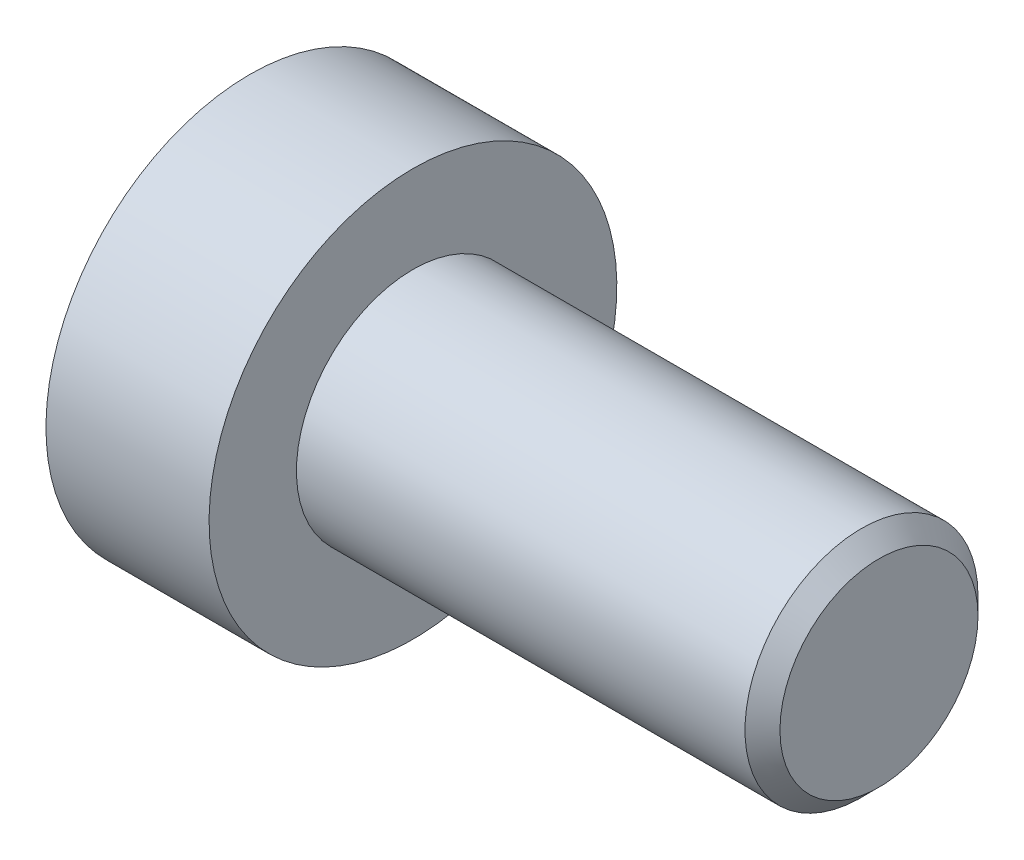
ISO-10303-21;
HEADER;
FILE_DESCRIPTION(('STEP AP214'),'2;1');
FILE_NAME('part.step','',(''),(''),'','','');
FILE_SCHEMA(('AUTOMOTIVE_DESIGN { 1 0 10303 214 1 1 1 1 }'));
ENDSEC;
DATA;
#1=APPLICATION_CONTEXT('core data for automotive mechanical design processes');
#2=APPLICATION_PROTOCOL_DEFINITION('international standard','automotive_design',2000,#1);
#3=PRODUCT_CONTEXT('',#1,'mechanical');
#4=PRODUCT('Part','Part','',(#3));
#5=PRODUCT_RELATED_PRODUCT_CATEGORY('part','',(#4));
#6=PRODUCT_DEFINITION_FORMATION('','',#4);
#7=PRODUCT_DEFINITION_CONTEXT('part definition',#1,'design');
#8=PRODUCT_DEFINITION('design','',#6,#7);
#9=PRODUCT_DEFINITION_SHAPE('','',#8);
#10=(LENGTH_UNIT() NAMED_UNIT(*) SI_UNIT(.MILLI.,.METRE.));
#11=(NAMED_UNIT(*) PLANE_ANGLE_UNIT() SI_UNIT($,.RADIAN.));
#12=(NAMED_UNIT(*) SI_UNIT($,.STERADIAN.) SOLID_ANGLE_UNIT());
#13=UNCERTAINTY_MEASURE_WITH_UNIT(LENGTH_MEASURE(1.E-05),#10,'distance_accuracy_value','');
#14=(GEOMETRIC_REPRESENTATION_CONTEXT(3) GLOBAL_UNCERTAINTY_ASSIGNED_CONTEXT((#13)) GLOBAL_UNIT_ASSIGNED_CONTEXT((#10,
#11,#12)) REPRESENTATION_CONTEXT('',''));
#15=CARTESIAN_POINT('',(0.,0.,0.));
#16=DIRECTION('',(0.,0.,1.));
#17=DIRECTION('',(1.,0.,0.));
#18=AXIS2_PLACEMENT_3D('',#15,#16,#17);
#19=CARTESIAN_POINT('',(-8.,0.,0.));
#20=DIRECTION('',(1.,0.,0.));
#21=DIRECTION('',(0.,0.,-1.));
#22=AXIS2_PLACEMENT_3D('',#19,#20,#21);
#23=CYLINDRICAL_SURFACE('',#22,2.);
#24=CARTESIAN_POINT('',(-0.300000000000001,0.,0.));
#25=DIRECTION('',(1.,0.,0.));
#26=DIRECTION('',(0.,0.,-1.));
#27=AXIS2_PLACEMENT_3D('',#24,#25,#26);
#28=CIRCLE('',#27,2.);
#29=CARTESIAN_POINT('',(-0.300000000000001,0.,-2.));
#30=VERTEX_POINT('',#29);
#31=EDGE_CURVE('E46',#30,#30,#28,.F.);
#32=ORIENTED_EDGE('',*,*,#31,.T.);
#33=EDGE_LOOP('',(#32));
#34=FACE_BOUND('',#33,.T.);
#35=CARTESIAN_POINT('',(-8.,0.,0.));
#36=DIRECTION('',(1.,0.,0.));
#37=DIRECTION('',(0.,1.,0.));
#38=AXIS2_PLACEMENT_3D('',#35,#36,#37);
#39=CIRCLE('',#38,2.);
#40=CARTESIAN_POINT('',(-8.,1.99999999999999,0.));
#41=VERTEX_POINT('',#40);
#42=EDGE_CURVE('E122',#41,#41,#39,.F.);
#43=ORIENTED_EDGE('',*,*,#42,.F.);
#44=EDGE_LOOP('',(#43));
#45=FACE_BOUND('',#44,.T.);
#46=ADVANCED_FACE('F33',(#34,#45),#23,.T.);
#47=CARTESIAN_POINT('',(0.,0.,0.));
#48=DIRECTION('',(1.,0.,0.));
#49=DIRECTION('',(0.,0.,-1.));
#50=AXIS2_PLACEMENT_3D('',#47,#48,#49);
#51=PLANE('',#50);
#52=CARTESIAN_POINT('',(0.,0.,0.));
#53=DIRECTION('',(1.,0.,0.));
#54=DIRECTION('',(0.,0.,-1.));
#55=AXIS2_PLACEMENT_3D('',#52,#53,#54);
#56=CIRCLE('',#55,1.7);
#57=CARTESIAN_POINT('',(0.,0.,-1.7));
#58=VERTEX_POINT('',#57);
#59=EDGE_CURVE('E125',#58,#58,#56,.T.);
#60=ORIENTED_EDGE('',*,*,#59,.T.);
#61=EDGE_LOOP('',(#60));
#62=FACE_BOUND('',#61,.T.);
#63=ADVANCED_FACE('F135',(#62),#51,.T.);
#64=CARTESIAN_POINT('',(0.,0.,0.));
#65=DIRECTION('',(-1.,0.,0.));
#66=DIRECTION('',(0.,0.,1.));
#67=AXIS2_PLACEMENT_3D('',#64,#65,#66);
#68=CONICAL_SURFACE('',#67,1.7,0.785398163397446);
#69=ORIENTED_EDGE('',*,*,#31,.F.);
#70=EDGE_LOOP('',(#69));
#71=FACE_BOUND('',#70,.T.);
#72=ORIENTED_EDGE('',*,*,#59,.F.);
#73=EDGE_LOOP('',(#72));
#74=FACE_BOUND('',#73,.T.);
#75=ADVANCED_FACE('F35',(#71,#74),#68,.T.);
#76=CARTESIAN_POINT('',(-10.8,0.,0.));
#77=DIRECTION('',(-1.,0.,0.));
#78=DIRECTION('',(0.,-1.,0.));
#79=AXIS2_PLACEMENT_3D('',#76,#77,#78);
#80=PLANE('',#79);
#81=CARTESIAN_POINT('',(-10.8,0.,0.));
#82=DIRECTION('',(-1.,0.,0.));
#83=DIRECTION('',(0.,-1.,0.));
#84=AXIS2_PLACEMENT_3D('',#81,#82,#83);
#85=CIRCLE('',#84,1.49337567297408);
#86=CARTESIAN_POINT('',(-10.8,-1.49337567297404,0.));
#87=VERTEX_POINT('',#86);
#88=EDGE_CURVE('E235',#87,#87,#85,.T.);
#89=ORIENTED_EDGE('',*,*,#88,.F.);
#90=EDGE_LOOP('',(#89));
#91=FACE_BOUND('',#90,.T.);
#92=CARTESIAN_POINT('',(-10.8,0.,0.));
#93=DIRECTION('',(1.,0.,0.));
#94=DIRECTION('',(0.,1.,0.));
#95=AXIS2_PLACEMENT_3D('',#92,#93,#94);
#96=CIRCLE('',#95,3.5);
#97=CARTESIAN_POINT('',(-10.8,3.5,0.));
#98=VERTEX_POINT('',#97);
#99=EDGE_CURVE('E119',#98,#98,#96,.T.);
#100=ORIENTED_EDGE('',*,*,#99,.F.);
#101=EDGE_LOOP('',(#100));
#102=FACE_BOUND('',#101,.T.);
#103=ADVANCED_FACE('F134',(#91,#102),#80,.T.);
#104=CARTESIAN_POINT('',(-8.,0.,0.));
#105=DIRECTION('',(1.,0.,0.));
#106=DIRECTION('',(0.,1.,0.));
#107=AXIS2_PLACEMENT_3D('',#104,#105,#106);
#108=CYLINDRICAL_SURFACE('',#107,3.5);
#109=ORIENTED_EDGE('',*,*,#99,.T.);
#110=EDGE_LOOP('',(#109));
#111=FACE_BOUND('',#110,.T.);
#112=CARTESIAN_POINT('',(-8.,0.,0.));
#113=DIRECTION('',(1.,0.,0.));
#114=DIRECTION('',(0.,1.,0.));
#115=AXIS2_PLACEMENT_3D('',#112,#113,#114);
#116=CIRCLE('',#115,3.5);
#117=CARTESIAN_POINT('',(-8.,3.5,0.));
#118=VERTEX_POINT('',#117);
#119=EDGE_CURVE('E116',#118,#118,#116,.T.);
#120=ORIENTED_EDGE('',*,*,#119,.F.);
#121=EDGE_LOOP('',(#120));
#122=FACE_BOUND('',#121,.T.);
#123=ADVANCED_FACE('F146',(#111,#122),#108,.T.);
#124=CARTESIAN_POINT('',(-8.,3.5,0.));
#125=DIRECTION('',(1.,0.,0.));
#126=DIRECTION('',(0.,1.,0.));
#127=AXIS2_PLACEMENT_3D('',#124,#125,#126);
#128=PLANE('',#127);
#129=ORIENTED_EDGE('',*,*,#42,.T.);
#130=EDGE_LOOP('',(#129));
#131=FACE_BOUND('',#130,.T.);
#132=ORIENTED_EDGE('',*,*,#119,.T.);
#133=EDGE_LOOP('',(#132));
#134=FACE_BOUND('',#133,.T.);
#135=ADVANCED_FACE('F150',(#131,#134),#128,.T.);
#136=CARTESIAN_POINT('',(-10.8,0.,0.));
#137=DIRECTION('',(-1.,0.,0.));
#138=DIRECTION('',(0.,-1.,0.));
#139=AXIS2_PLACEMENT_3D('',#136,#137,#138);
#140=CONICAL_SURFACE('',#139,1.49337567297408,0.78539816339745);
#141=ORIENTED_EDGE('',*,*,#88,.T.);
#142=EDGE_LOOP('',(#141));
#143=FACE_BOUND('',#142,.T.);
#144=CARTESIAN_POINT('',(-11.2014021689884,-1.42396736984797,1.25));
#145=CARTESIAN_POINT('',(-11.175296136448,-1.38922450814774,1.25));
#146=CARTESIAN_POINT('',(-11.1494506563431,-1.35428640192995,1.25));
#147=CARTESIAN_POINT('',(-11.0983879120234,-1.28394100441962,1.25));
#148=CARTESIAN_POINT('',(-11.0731708093588,-1.24853359598576,1.25));
#149=CARTESIAN_POINT('',(-10.9982633539511,-1.14097140016119,1.25));
#150=CARTESIAN_POINT('',(-10.9497190435972,-1.0680049582675,1.25));
#151=CARTESIAN_POINT('',(-10.8545600162985,-0.915095472420343,1.25));
#152=CARTESIAN_POINT('',(-10.8082030382604,-0.834990154954485,1.25));
#153=CARTESIAN_POINT('',(-10.7235039270025,-0.670798348959402,1.25));
#154=CARTESIAN_POINT('',(-10.6851347978723,-0.58672648793715,1.25));
#155=CARTESIAN_POINT('',(-10.6381985020476,-0.460385334768688,1.25));
#156=CARTESIAN_POINT('',(-10.6247021207698,-0.419954113336594,1.25));
#157=CARTESIAN_POINT('',(-10.6009573074475,-0.338129031291272,1.25));
#158=CARTESIAN_POINT('',(-10.5907091035293,-0.296735103284165,1.25));
#159=CARTESIAN_POINT('',(-10.5741594663552,-0.213916243687779,1.25));
#160=CARTESIAN_POINT('',(-10.5677913385525,-0.172504848949327,1.25));
#161=CARTESIAN_POINT('',(-10.5591237196608,-0.0892560954741847,1.25));
#162=CARTESIAN_POINT('',(-10.5568235599982,-0.0474188078702925,1.25));
#163=CARTESIAN_POINT('',(-10.5564564105193,0.0348235296905143,1.25));
#164=CARTESIAN_POINT('',(-10.5582455485416,0.0752279922916913,1.25));
#165=CARTESIAN_POINT('',(-10.5656448035135,0.15568700557962,1.25));
#166=CARTESIAN_POINT('',(-10.5712556629701,0.195741486737974,1.25));
#167=CARTESIAN_POINT('',(-10.5860898151071,0.275882483894682,1.25));
#168=CARTESIAN_POINT('',(-10.5953738895404,0.315957579678786,1.25));
#169=CARTESIAN_POINT('',(-10.6170656964992,0.395234027395294,1.25));
#170=CARTESIAN_POINT('',(-10.6294731489784,0.434435457318934,1.25));
#171=CARTESIAN_POINT('',(-10.6734108304631,0.558570325397133,1.25));
#172=CARTESIAN_POINT('',(-10.7099744143289,0.641718054005954,1.25));
#173=CARTESIAN_POINT('',(-10.7912478873066,0.804100725662095,1.25));
#174=CARTESIAN_POINT('',(-10.8359871895297,0.883320183915885,1.25));
#175=CARTESIAN_POINT('',(-10.9282652286461,1.03470895505823,1.25));
#176=CARTESIAN_POINT('',(-10.9755534388818,1.10703287925039,1.25));
#177=CARTESIAN_POINT('',(-11.0486463209253,1.21358798649192,1.25));
#178=CARTESIAN_POINT('',(-11.0732664432996,1.24864609054883,1.25));
#179=CARTESIAN_POINT('',(-11.123155260131,1.3182838080565,1.25));
#180=CARTESIAN_POINT('',(-11.1484237758017,1.35286354944695,1.25));
#181=CARTESIAN_POINT('',(-11.1739610581169,1.38724419886389,1.25));
#182=B_SPLINE_CURVE_WITH_KNOTS('',3,(#144,#145,#146,#147,#148,#149,#150,#151,#152,#153,#154,
#155,#156,#157,#158,#159,#160,#161,#162,#163,#164,#165,#166,#167,#168,#169,#170,#171,#172,#173,
#174,#175,#176,#177,#178,#179,#180,#181),.UNSPECIFIED.,.F.,.F.,(4,2,2,2,2,2,2,2,2,2,2,2,2,2,2,2,
2,2,4),(0.,0.130370422461749,0.26077402322928,0.523571931962181,0.800995227642792,
1.07746514553942,1.20522972687283,1.33300327939672,1.45851355132216,1.5840031936199,
1.70514602294322,1.82631239533597,1.94957373840992,2.07282403363807,2.34451838945522,
2.61721016161585,2.87631588769062,3.00482945023601,3.13330794967362),.UNSPECIFIED.);
#183=CARTESIAN_POINT('',(-10.75,-0.721687836486992,1.25));
#184=VERTEX_POINT('',#183);
#185=CARTESIAN_POINT('',(-10.75,0.721687836487073,1.25));
#186=VERTEX_POINT('',#185);
#187=EDGE_CURVE('E100',#184,#186,#182,.T.);
#188=ORIENTED_EDGE('',*,*,#187,.F.);
#189=CARTESIAN_POINT('',(-10.7501154839091,-1.44349114302786,-0.000200000000000846));
#190=CARTESIAN_POINT('',(-10.7253216680551,-1.41867941875061,0.0427751670715858));
#191=CARTESIAN_POINT('',(-10.7019837344187,-1.39345276980739,0.0864690047459472));
#192=CARTESIAN_POINT('',(-10.6592520040845,-1.3420126355419,0.175565930841941));
#193=CARTESIAN_POINT('',(-10.6398819923604,-1.31579425481272,0.220977498357063));
#194=CARTESIAN_POINT('',(-10.6067004834135,-1.26292610442242,0.312547820935259));
#195=CARTESIAN_POINT('',(-10.5928055590526,-1.23628980770467,0.358683240175884));
#196=CARTESIAN_POINT('',(-10.5713972821606,-1.18243062538504,0.451970080407591));
#197=CARTESIAN_POINT('',(-10.5638679415668,-1.15520938653757,0.499118649136378));
#198=CARTESIAN_POINT('',(-10.5570744980507,-1.10829684367463,0.58037355688725));
#199=CARTESIAN_POINT('',(-10.5560685591043,-1.08866617256954,0.614374876627939));
#200=CARTESIAN_POINT('',(-10.5577614149113,-1.04943932800607,0.682317764432475));
#201=CARTESIAN_POINT('',(-10.5604610272155,-1.02984316311595,0.716259317655656));
#202=CARTESIAN_POINT('',(-10.5694089303164,-0.99083995460346,0.783814856457497));
#203=CARTESIAN_POINT('',(-10.5756605258997,-0.971433104248731,0.817428507286773));
#204=CARTESIAN_POINT('',(-10.5913756814139,-0.932943395609866,0.884094638217811));
#205=CARTESIAN_POINT('',(-10.6008406200874,-0.913860680098261,0.917146871030293));
#206=CARTESIAN_POINT('',(-10.6289313906876,-0.864986351354528,1.00179969160026));
#207=CARTESIAN_POINT('',(-10.6496701574522,-0.835502920149036,1.05286649242964));
#208=CARTESIAN_POINT('',(-10.6963871346715,-0.777690319475868,1.15300085411325));
#209=CARTESIAN_POINT('',(-10.7223482959468,-0.749357745598376,1.20207431157827));
#210=CARTESIAN_POINT('',(-10.7501154839091,-0.721572366433154,1.2502));
#211=B_SPLINE_CURVE_WITH_KNOTS('',3,(#189,#190,#191,#192,#193,#194,#195,#196,#197,#198,#199,
#200,#201,#202,#203,#204,#205,#206,#207,#208,#209,#210),.UNSPECIFIED.,.F.,.F.,(4,2,2,2,2,2,2,2,
2,2,4),(0.,0.166533409618304,0.334037607289761,0.498880396489697,0.663307919240273,
0.780963963458825,0.898645970148451,1.01643764860773,1.13427993171549,1.32148652032141,
1.50809158792573),.UNSPECIFIED.);
#212=CARTESIAN_POINT('',(-10.75,-1.44337567297402,0.));
#213=VERTEX_POINT('',#212);
#214=EDGE_CURVE('E192',#213,#184,#211,.T.);
#215=ORIENTED_EDGE('',*,*,#214,.F.);
#216=CARTESIAN_POINT('',(-10.7501154839091,-0.721572366433153,-1.2502));
#217=CARTESIAN_POINT('',(-10.7253216680551,-0.746384090710403,-1.20722483292841));
#218=CARTESIAN_POINT('',(-10.7019837344187,-0.771610739653623,-1.16353099525405));
#219=CARTESIAN_POINT('',(-10.6592520040845,-0.823050873919114,-1.07443406915806));
#220=CARTESIAN_POINT('',(-10.6398819923604,-0.849269254648293,-1.02902250164294));
#221=CARTESIAN_POINT('',(-10.6067004834135,-0.902137405038595,-0.937452179064739));
#222=CARTESIAN_POINT('',(-10.5928055590526,-0.928773701756347,-0.891316759824114));
#223=CARTESIAN_POINT('',(-10.5713972821606,-0.982632884075973,-0.798029919592407));
#224=CARTESIAN_POINT('',(-10.5638679415668,-1.00985412292344,-0.750881350863619));
#225=CARTESIAN_POINT('',(-10.5570744980507,-1.05676666578639,-0.669626443112746));
#226=CARTESIAN_POINT('',(-10.5560685591043,-1.07639733689148,-0.635625123372058));
#227=CARTESIAN_POINT('',(-10.5577614149113,-1.11562418145495,-0.567682235567521));
#228=CARTESIAN_POINT('',(-10.5604610272155,-1.13522034634506,-0.533740682344341));
#229=CARTESIAN_POINT('',(-10.5694089303164,-1.17422355485756,-0.466185143542499));
#230=CARTESIAN_POINT('',(-10.5756605258997,-1.19363040521229,-0.432571492713224));
#231=CARTESIAN_POINT('',(-10.5913756814139,-1.23212011385115,-0.365905361782185));
#232=CARTESIAN_POINT('',(-10.6008406200874,-1.25120282936276,-0.332853128969703));
#233=CARTESIAN_POINT('',(-10.6289313906876,-1.30007715810649,-0.248200308399735));
#234=CARTESIAN_POINT('',(-10.6496701574522,-1.32956058931198,-0.197133507570361));
#235=CARTESIAN_POINT('',(-10.6963871346715,-1.38737318998515,-0.0969991458867454));
#236=CARTESIAN_POINT('',(-10.7223482959468,-1.41570576386264,-0.0479256884217312));
#237=CARTESIAN_POINT('',(-10.7501154839091,-1.44349114302786,0.000199999999998906));
#238=B_SPLINE_CURVE_WITH_KNOTS('',3,(#216,#217,#218,#219,#220,#221,#222,#223,#224,#225,#226,
#227,#228,#229,#230,#231,#232,#233,#234,#235,#236,#237),.UNSPECIFIED.,.F.,.F.,(4,2,2,2,2,2,2,2,
2,2,4),(0.,0.166533409618305,0.334037607289763,0.4988803964897,0.663307919240276,
0.780963963458829,0.898645970148455,1.01643764860774,1.1342799317155,1.32148652032141,
1.50809158792573),.UNSPECIFIED.);
#239=CARTESIAN_POINT('',(-10.75,-0.721687836486991,-1.25));
#240=VERTEX_POINT('',#239);
#241=EDGE_CURVE('E187',#240,#213,#238,.T.);
#242=ORIENTED_EDGE('',*,*,#241,.F.);
#243=CARTESIAN_POINT('',(-11.2014021689884,-1.42396736984797,-1.25));
#244=CARTESIAN_POINT('',(-11.175296136448,-1.38922450814774,-1.25));
#245=CARTESIAN_POINT('',(-11.1494506563431,-1.35428640192996,-1.25));
#246=CARTESIAN_POINT('',(-11.0983879120234,-1.28394100441962,-1.25));
#247=CARTESIAN_POINT('',(-11.0731708093588,-1.24853359598576,-1.25));
#248=CARTESIAN_POINT('',(-10.9982633539511,-1.14097140016119,-1.25));
#249=CARTESIAN_POINT('',(-10.9497190435972,-1.0680049582675,-1.25));
#250=CARTESIAN_POINT('',(-10.8545600162985,-0.915095472420343,-1.25));
#251=CARTESIAN_POINT('',(-10.8082030382604,-0.834990154954486,-1.25));
#252=CARTESIAN_POINT('',(-10.7235039270025,-0.670798348959403,-1.25));
#253=CARTESIAN_POINT('',(-10.6851347978723,-0.58672648793715,-1.25));
#254=CARTESIAN_POINT('',(-10.6381985020476,-0.460385334768688,-1.25));
#255=CARTESIAN_POINT('',(-10.6247021207698,-0.419954113336594,-1.25));
#256=CARTESIAN_POINT('',(-10.6009573074475,-0.338129031291272,-1.25));
#257=CARTESIAN_POINT('',(-10.5907091035293,-0.296735103284165,-1.25));
#258=CARTESIAN_POINT('',(-10.5741594663553,-0.213916243687779,-1.25));
#259=CARTESIAN_POINT('',(-10.5677913385525,-0.172504848949327,-1.25));
#260=CARTESIAN_POINT('',(-10.5591237196608,-0.0892560954741849,-1.25));
#261=CARTESIAN_POINT('',(-10.5568235599982,-0.0474188078702929,-1.25));
#262=CARTESIAN_POINT('',(-10.5564564105193,0.0348235296905139,-1.25));
#263=CARTESIAN_POINT('',(-10.5582455485416,0.0752279922916908,-1.25));
#264=CARTESIAN_POINT('',(-10.5656448035135,0.155687005579619,-1.25));
#265=CARTESIAN_POINT('',(-10.5712556629701,0.195741486737974,-1.25));
#266=CARTESIAN_POINT('',(-10.5860898151071,0.275882483894681,-1.25));
#267=CARTESIAN_POINT('',(-10.5953738895404,0.315957579678785,-1.25));
#268=CARTESIAN_POINT('',(-10.6170656964992,0.395234027395293,-1.25));
#269=CARTESIAN_POINT('',(-10.6294731489784,0.434435457318933,-1.25));
#270=CARTESIAN_POINT('',(-10.6734108304631,0.558570325397132,-1.25));
#271=CARTESIAN_POINT('',(-10.7099744143289,0.641718054005952,-1.25));
#272=CARTESIAN_POINT('',(-10.7912478873066,0.804100725662093,-1.25));
#273=CARTESIAN_POINT('',(-10.8359871895297,0.883320183915883,-1.25));
#274=CARTESIAN_POINT('',(-10.9282652286461,1.03470895505823,-1.25));
#275=CARTESIAN_POINT('',(-10.9755534388818,1.10703287925039,-1.25));
#276=CARTESIAN_POINT('',(-11.0486463209253,1.21358798649192,-1.25));
#277=CARTESIAN_POINT('',(-11.0732664432996,1.24864609054883,-1.25));
#278=CARTESIAN_POINT('',(-11.123155260131,1.3182838080565,-1.25));
#279=CARTESIAN_POINT('',(-11.1484237758017,1.35286354944695,-1.25));
#280=CARTESIAN_POINT('',(-11.1739610581169,1.38724419886389,-1.25));
#281=B_SPLINE_CURVE_WITH_KNOTS('',3,(#243,#244,#245,#246,#247,#248,#249,#250,#251,#252,#253,
#254,#255,#256,#257,#258,#259,#260,#261,#262,#263,#264,#265,#266,#267,#268,#269,#270,#271,#272,
#273,#274,#275,#276,#277,#278,#279,#280),.UNSPECIFIED.,.F.,.F.,(4,2,2,2,2,2,2,2,2,2,2,2,2,2,2,2,
2,2,4),(0.,0.130370422461748,0.260774023229279,0.523571931962181,0.800995227642793,
1.07746514553942,1.20522972687283,1.33300327939672,1.45851355132216,1.5840031936199,
1.70514602294322,1.82631239533597,1.94957373840992,2.07282403363807,2.34451838945522,
2.61721016161585,2.87631588769062,3.00482945023601,3.13330794967362),.UNSPECIFIED.);
#282=CARTESIAN_POINT('',(-10.75,0.721687836487073,-1.25));
#283=VERTEX_POINT('',#282);
#284=EDGE_CURVE('E53',#283,#240,#281,.F.);
#285=ORIENTED_EDGE('',*,*,#284,.F.);
#286=CARTESIAN_POINT('',(-10.7501154839091,1.44349114302794,0.000200000000000304));
#287=CARTESIAN_POINT('',(-10.7253216680551,1.41867941875069,-0.0427751670715863));
#288=CARTESIAN_POINT('',(-10.7019837344187,1.39345276980747,-0.0864690047459477));
#289=CARTESIAN_POINT('',(-10.6592520040845,1.34201263554198,-0.175565930841942));
#290=CARTESIAN_POINT('',(-10.6398819923604,1.3157942548128,-0.220977498357063));
#291=CARTESIAN_POINT('',(-10.6067004834135,1.2629261044225,-0.312547820935259));
#292=CARTESIAN_POINT('',(-10.5928055590526,1.23628980770475,-0.358683240175886));
#293=CARTESIAN_POINT('',(-10.5713972821606,1.18243062538512,-0.451970080407592));
#294=CARTESIAN_POINT('',(-10.5638679415668,1.15520938653765,-0.49911864913638));
#295=CARTESIAN_POINT('',(-10.5570744980507,1.10829684367471,-0.580373556887252));
#296=CARTESIAN_POINT('',(-10.5560685591043,1.08866617256962,-0.614374876627941));
#297=CARTESIAN_POINT('',(-10.5577614149113,1.04943932800615,-0.682317764432477));
#298=CARTESIAN_POINT('',(-10.5604610272155,1.02984316311603,-0.716259317655658));
#299=CARTESIAN_POINT('',(-10.5694089303164,0.99083995460354,-0.783814856457499));
#300=CARTESIAN_POINT('',(-10.5756605258997,0.971433104248811,-0.817428507286775));
#301=CARTESIAN_POINT('',(-10.5913756814139,0.932943395609946,-0.884094638217813));
#302=CARTESIAN_POINT('',(-10.6008406200874,0.913860680098341,-0.917146871030295));
#303=CARTESIAN_POINT('',(-10.6289313906876,0.864986351354608,-1.00179969160026));
#304=CARTESIAN_POINT('',(-10.6496701574522,0.835502920149116,-1.05286649242964));
#305=CARTESIAN_POINT('',(-10.6963871346715,0.777690319475949,-1.15300085411325));
#306=CARTESIAN_POINT('',(-10.7223482959467,0.749357745598458,-1.20207431157827));
#307=CARTESIAN_POINT('',(-10.7501154839091,0.721572366433236,-1.2502));
#308=B_SPLINE_CURVE_WITH_KNOTS('',3,(#286,#287,#288,#289,#290,#291,#292,#293,#294,#295,#296,
#297,#298,#299,#300,#301,#302,#303,#304,#305,#306,#307),.UNSPECIFIED.,.F.,.F.,(4,2,2,2,2,2,2,2,
2,2,4),(0.,0.166533409618304,0.334037607289761,0.498880396489698,0.663307919240275,
0.780963963458827,0.898645970148453,1.01643764860773,1.13427993171549,1.32148652032141,
1.50809158792574),.UNSPECIFIED.);
#309=CARTESIAN_POINT('',(-10.75,1.4433756729741,0.));
#310=VERTEX_POINT('',#309);
#311=EDGE_CURVE('E11',#310,#283,#308,.T.);
#312=ORIENTED_EDGE('',*,*,#311,.F.);
#313=CARTESIAN_POINT('',(-10.7501154839091,0.721572366433235,1.2502));
#314=CARTESIAN_POINT('',(-10.7253216680551,0.746384090710485,1.20722483292841));
#315=CARTESIAN_POINT('',(-10.7019837344187,0.771610739653705,1.16353099525405));
#316=CARTESIAN_POINT('',(-10.6592520040845,0.823050873919195,1.07443406915806));
#317=CARTESIAN_POINT('',(-10.6398819923604,0.849269254648373,1.02902250164294));
#318=CARTESIAN_POINT('',(-10.6067004834135,0.902137405038675,0.937452179064742));
#319=CARTESIAN_POINT('',(-10.5928055590526,0.928773701756426,0.891316759824116));
#320=CARTESIAN_POINT('',(-10.5713972821606,0.982632884076051,0.79802991959241));
#321=CARTESIAN_POINT('',(-10.5638679415668,1.00985412292352,0.750881350863622));
#322=CARTESIAN_POINT('',(-10.5570744980507,1.05676666578647,0.66962644311275));
#323=CARTESIAN_POINT('',(-10.5560685591043,1.07639733689156,0.635625123372062));
#324=CARTESIAN_POINT('',(-10.5577614149113,1.11562418145503,0.567682235567525));
#325=CARTESIAN_POINT('',(-10.5604610272155,1.13522034634514,0.533740682344345));
#326=CARTESIAN_POINT('',(-10.5694089303164,1.17422355485764,0.466185143542503));
#327=CARTESIAN_POINT('',(-10.5756605258997,1.19363040521236,0.432571492713228));
#328=CARTESIAN_POINT('',(-10.5913756814139,1.23212011385123,0.36590536178219));
#329=CARTESIAN_POINT('',(-10.6008406200874,1.25120282936283,0.332853128969707));
#330=CARTESIAN_POINT('',(-10.6289313906876,1.30007715810657,0.248200308399738));
#331=CARTESIAN_POINT('',(-10.6496701574522,1.32956058931206,0.197133507570364));
#332=CARTESIAN_POINT('',(-10.6963871346715,1.38737318998523,0.0969991458867468));
#333=CARTESIAN_POINT('',(-10.7223482959467,1.41570576386272,0.0479256884217317));
#334=CARTESIAN_POINT('',(-10.7501154839091,1.44349114302794,-0.000199999999999465));
#335=B_SPLINE_CURVE_WITH_KNOTS('',3,(#313,#314,#315,#316,#317,#318,#319,#320,#321,#322,#323,
#324,#325,#326,#327,#328,#329,#330,#331,#332,#333,#334),.UNSPECIFIED.,.F.,.F.,(4,2,2,2,2,2,2,2,
2,2,4),(0.,0.166533409618302,0.334037607289759,0.498880396489695,0.66330791924027,
0.780963963458822,0.898645970148449,1.01643764860773,1.13427993171549,1.3214865203214,
1.50809158792573),.UNSPECIFIED.);
#336=EDGE_CURVE('E91',#186,#310,#335,.T.);
#337=ORIENTED_EDGE('',*,*,#336,.F.);
#338=EDGE_LOOP('',(#188,#215,#242,#285,#312,#337));
#339=FACE_BOUND('',#338,.T.);
#340=ADVANCED_FACE('F90',(#143,#339),#140,.F.);
#341=CARTESIAN_POINT('',(-9.2,0.,0.));
#342=DIRECTION('',(-1.,0.,0.));
#343=DIRECTION('',(0.,-1.,0.));
#344=AXIS2_PLACEMENT_3D('',#341,#342,#343);
#345=PLANE('',#344);
#346=DIRECTION('',(0.,0.5,-0.866025403784438));
#347=VECTOR('',#346,1.);
#348=CARTESIAN_POINT('',(-9.2,0.721687836487067,1.25));
#349=LINE('',#348,#347);
#350=CARTESIAN_POINT('',(-9.2,0.721687836487067,1.25));
#351=VERTEX_POINT('',#350);
#352=CARTESIAN_POINT('',(-9.19999999999999,1.4433756729741,0.));
#353=VERTEX_POINT('',#352);
#354=EDGE_CURVE('E99',#351,#353,#349,.T.);
#355=ORIENTED_EDGE('',*,*,#354,.T.);
#356=DIRECTION('',(0.,-0.5,-0.866025403784439));
#357=VECTOR('',#356,1.);
#358=CARTESIAN_POINT('',(-9.19999999999999,1.4433756729741,0.));
#359=LINE('',#358,#357);
#360=CARTESIAN_POINT('',(-9.2,0.721687836487067,-1.25));
#361=VERTEX_POINT('',#360);
#362=EDGE_CURVE('E104',#353,#361,#359,.T.);
#363=ORIENTED_EDGE('',*,*,#362,.T.);
#364=DIRECTION('',(0.,-1.,0.));
#365=VECTOR('',#364,1.);
#366=CARTESIAN_POINT('',(-9.2,0.721687836487067,-1.25));
#367=LINE('',#366,#365);
#368=CARTESIAN_POINT('',(-9.2,-0.721687836486997,-1.25));
#369=VERTEX_POINT('',#368);
#370=EDGE_CURVE('E217',#361,#369,#367,.T.);
#371=ORIENTED_EDGE('',*,*,#370,.T.);
#372=DIRECTION('',(0.,-0.5,0.866025403784438));
#373=VECTOR('',#372,1.);
#374=CARTESIAN_POINT('',(-9.2,-0.721687836486997,-1.25));
#375=LINE('',#374,#373);
#376=CARTESIAN_POINT('',(-9.2,-1.44337567297403,0.));
#377=VERTEX_POINT('',#376);
#378=EDGE_CURVE('E221',#369,#377,#375,.T.);
#379=ORIENTED_EDGE('',*,*,#378,.T.);
#380=DIRECTION('',(0.,0.5,0.866025403784439));
#381=VECTOR('',#380,1.);
#382=CARTESIAN_POINT('',(-9.2,-1.44337567297403,0.));
#383=LINE('',#382,#381);
#384=CARTESIAN_POINT('',(-9.2,-0.721687836486997,1.25));
#385=VERTEX_POINT('',#384);
#386=EDGE_CURVE('E112',#377,#385,#383,.T.);
#387=ORIENTED_EDGE('',*,*,#386,.T.);
#388=DIRECTION('',(0.,1.,0.));
#389=VECTOR('',#388,1.);
#390=CARTESIAN_POINT('',(-9.2,-0.721687836486997,1.25));
#391=LINE('',#390,#389);
#392=EDGE_CURVE('E107',#385,#351,#391,.T.);
#393=ORIENTED_EDGE('',*,*,#392,.T.);
#394=EDGE_LOOP('',(#355,#363,#371,#379,#387,#393));
#395=FACE_BOUND('',#394,.T.);
#396=ADVANCED_FACE('F174',(#395),#345,.T.);
#397=CARTESIAN_POINT('',(-9.19999999999999,1.4433756729741,0.));
#398=DIRECTION('',(0.,0.866025403784439,-0.5));
#399=DIRECTION('',(0.,0.5,0.866025403784439));
#400=AXIS2_PLACEMENT_3D('',#397,#398,#399);
#401=PLANE('',#400);
#402=DIRECTION('',(-1.,0.,0.));
#403=VECTOR('',#402,1.);
#404=CARTESIAN_POINT('',(-9.19999999999999,1.4433756729741,0.));
#405=LINE('',#404,#403);
#406=EDGE_CURVE('E97',#353,#310,#405,.T.);
#407=ORIENTED_EDGE('',*,*,#406,.T.);
#408=ORIENTED_EDGE('',*,*,#311,.T.);
#409=DIRECTION('',(-1.,0.,0.));
#410=VECTOR('',#409,1.);
#411=CARTESIAN_POINT('',(-9.2,0.721687836487067,-1.25));
#412=LINE('',#411,#410);
#413=EDGE_CURVE('E106',#361,#283,#412,.T.);
#414=ORIENTED_EDGE('',*,*,#413,.F.);
#415=ORIENTED_EDGE('',*,*,#362,.F.);
#416=EDGE_LOOP('',(#407,#408,#414,#415));
#417=FACE_BOUND('',#416,.T.);
#418=ADVANCED_FACE('F102',(#417),#401,.F.);
#419=CARTESIAN_POINT('',(-9.2,0.721687836487067,-1.25));
#420=DIRECTION('',(0.,0.,-1.));
#421=DIRECTION('',(-1.,0.,0.));
#422=AXIS2_PLACEMENT_3D('',#419,#420,#421);
#423=PLANE('',#422);
#424=ORIENTED_EDGE('',*,*,#413,.T.);
#425=ORIENTED_EDGE('',*,*,#284,.T.);
#426=DIRECTION('',(-1.,0.,0.));
#427=VECTOR('',#426,1.);
#428=CARTESIAN_POINT('',(-9.2,-0.721687836486997,-1.25));
#429=LINE('',#428,#427);
#430=EDGE_CURVE('E109',#369,#240,#429,.T.);
#431=ORIENTED_EDGE('',*,*,#430,.F.);
#432=ORIENTED_EDGE('',*,*,#370,.F.);
#433=EDGE_LOOP('',(#424,#425,#431,#432));
#434=FACE_BOUND('',#433,.T.);
#435=ADVANCED_FACE('F206',(#434),#423,.F.);
#436=CARTESIAN_POINT('',(-9.2,-0.721687836486997,-1.25));
#437=DIRECTION('',(0.,-0.866025403784438,-0.5));
#438=DIRECTION('',(0.,0.5,-0.866025403784439));
#439=AXIS2_PLACEMENT_3D('',#436,#437,#438);
#440=PLANE('',#439);
#441=ORIENTED_EDGE('',*,*,#430,.T.);
#442=ORIENTED_EDGE('',*,*,#241,.T.);
#443=DIRECTION('',(-1.,0.,0.));
#444=VECTOR('',#443,1.);
#445=CARTESIAN_POINT('',(-9.2,-1.44337567297403,0.));
#446=LINE('',#445,#444);
#447=EDGE_CURVE('E231',#377,#213,#446,.T.);
#448=ORIENTED_EDGE('',*,*,#447,.F.);
#449=ORIENTED_EDGE('',*,*,#378,.F.);
#450=EDGE_LOOP('',(#441,#442,#448,#449));
#451=FACE_BOUND('',#450,.T.);
#452=ADVANCED_FACE('F201',(#451),#440,.F.);
#453=CARTESIAN_POINT('',(-9.2,-1.44337567297403,0.));
#454=DIRECTION('',(0.,-0.866025403784439,0.5));
#455=DIRECTION('',(0.,-0.5,-0.866025403784439));
#456=AXIS2_PLACEMENT_3D('',#453,#454,#455);
#457=PLANE('',#456);
#458=ORIENTED_EDGE('',*,*,#447,.T.);
#459=ORIENTED_EDGE('',*,*,#214,.T.);
#460=DIRECTION('',(-1.,0.,0.));
#461=VECTOR('',#460,1.);
#462=CARTESIAN_POINT('',(-9.2,-0.721687836486997,1.25));
#463=LINE('',#462,#461);
#464=EDGE_CURVE('E228',#385,#184,#463,.T.);
#465=ORIENTED_EDGE('',*,*,#464,.F.);
#466=ORIENTED_EDGE('',*,*,#386,.F.);
#467=EDGE_LOOP('',(#458,#459,#465,#466));
#468=FACE_BOUND('',#467,.T.);
#469=ADVANCED_FACE('F198',(#468),#457,.F.);
#470=CARTESIAN_POINT('',(-9.2,-0.721687836486997,1.25));
#471=DIRECTION('',(0.,0.,1.));
#472=DIRECTION('',(1.,0.,0.));
#473=AXIS2_PLACEMENT_3D('',#470,#471,#472);
#474=PLANE('',#473);
#475=ORIENTED_EDGE('',*,*,#464,.T.);
#476=ORIENTED_EDGE('',*,*,#187,.T.);
#477=DIRECTION('',(-1.,0.,0.));
#478=VECTOR('',#477,1.);
#479=CARTESIAN_POINT('',(-9.2,0.721687836487067,1.25));
#480=LINE('',#479,#478);
#481=EDGE_CURVE('E60',#351,#186,#480,.T.);
#482=ORIENTED_EDGE('',*,*,#481,.F.);
#483=ORIENTED_EDGE('',*,*,#392,.F.);
#484=EDGE_LOOP('',(#475,#476,#482,#483));
#485=FACE_BOUND('',#484,.T.);
#486=ADVANCED_FACE('F157',(#485),#474,.F.);
#487=CARTESIAN_POINT('',(-9.2,0.721687836487067,1.25));
#488=DIRECTION('',(0.,0.866025403784438,0.5));
#489=DIRECTION('',(0.,-0.5,0.866025403784439));
#490=AXIS2_PLACEMENT_3D('',#487,#488,#489);
#491=PLANE('',#490);
#492=ORIENTED_EDGE('',*,*,#481,.T.);
#493=ORIENTED_EDGE('',*,*,#336,.T.);
#494=ORIENTED_EDGE('',*,*,#406,.F.);
#495=ORIENTED_EDGE('',*,*,#354,.F.);
#496=EDGE_LOOP('',(#492,#493,#494,#495));
#497=FACE_BOUND('',#496,.T.);
#498=ADVANCED_FACE('F96',(#497),#491,.F.);
#499=CLOSED_SHELL('',(#46,#63,#75,#103,#123,#135,#340,#396,#418,#435,#452,#469,#486,#498));
#500=MANIFOLD_SOLID_BREP('B2',#499);
#501=ADVANCED_BREP_SHAPE_REPRESENTATION('',(#18,#500),#14);
#502=SHAPE_DEFINITION_REPRESENTATION(#9,#501);
ENDSEC;
END-ISO-10303-21;
